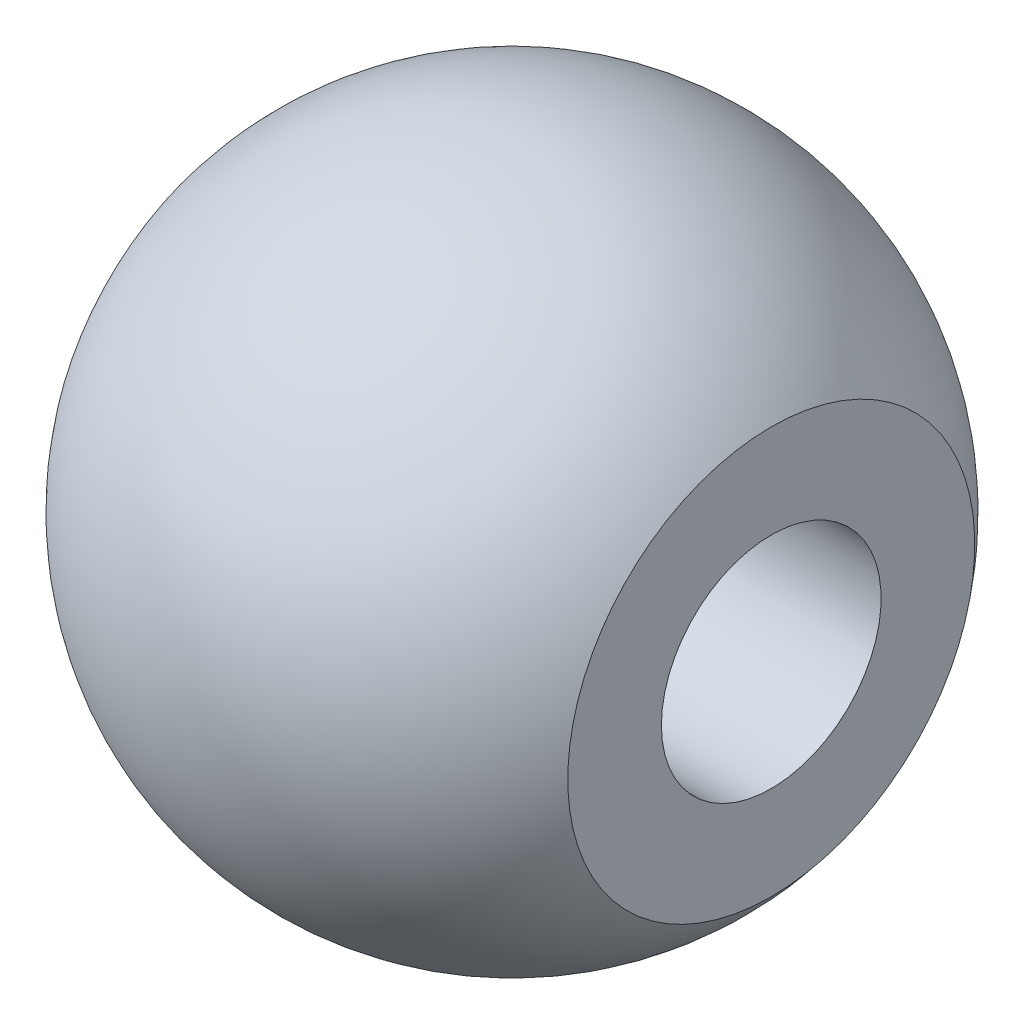
ISO-10303-21;
HEADER;
FILE_DESCRIPTION(('STEP AP214'),'2;1');
FILE_NAME('part.step','',(''),(''),'','','');
FILE_SCHEMA(('AUTOMOTIVE_DESIGN { 1 0 10303 214 1 1 1 1 }'));
ENDSEC;
DATA;
#1=APPLICATION_CONTEXT('core data for automotive mechanical design processes');
#2=APPLICATION_PROTOCOL_DEFINITION('international standard','automotive_design',2000,#1);
#3=PRODUCT_CONTEXT('',#1,'mechanical');
#4=PRODUCT('Part','Part','',(#3));
#5=PRODUCT_RELATED_PRODUCT_CATEGORY('part','',(#4));
#6=PRODUCT_DEFINITION_FORMATION('','',#4);
#7=PRODUCT_DEFINITION_CONTEXT('part definition',#1,'design');
#8=PRODUCT_DEFINITION('design','',#6,#7);
#9=PRODUCT_DEFINITION_SHAPE('','',#8);
#10=(LENGTH_UNIT() NAMED_UNIT(*) SI_UNIT(.MILLI.,.METRE.));
#11=(NAMED_UNIT(*) PLANE_ANGLE_UNIT() SI_UNIT($,.RADIAN.));
#12=(NAMED_UNIT(*) SI_UNIT($,.STERADIAN.) SOLID_ANGLE_UNIT());
#13=UNCERTAINTY_MEASURE_WITH_UNIT(LENGTH_MEASURE(1.E-05),#10,'distance_accuracy_value','');
#14=(GEOMETRIC_REPRESENTATION_CONTEXT(3) GLOBAL_UNCERTAINTY_ASSIGNED_CONTEXT((#13)) GLOBAL_UNIT_ASSIGNED_CONTEXT((#10,
#11,#12)) REPRESENTATION_CONTEXT('',''));
#15=CARTESIAN_POINT('',(0.,0.,0.));
#16=DIRECTION('',(0.,0.,1.));
#17=DIRECTION('',(1.,0.,0.));
#18=AXIS2_PLACEMENT_3D('',#15,#16,#17);
#19=CARTESIAN_POINT('',(-4.72,3.70426780889288,-6.));
#20=DIRECTION('',(1.,0.,0.));
#21=DIRECTION('',(0.,1.,0.));
#22=AXIS2_PLACEMENT_3D('',#19,#20,#21);
#23=PLANE('',#22);
#24=CARTESIAN_POINT('',(-4.72,0.,0.));
#25=DIRECTION('',(1.,0.,0.));
#26=DIRECTION('',(0.,1.,0.));
#27=AXIS2_PLACEMENT_3D('',#24,#25,#26);
#28=CIRCLE('',#27,3.70426780889287);
#29=CARTESIAN_POINT('',(-4.72,3.70426780889287,0.));
#30=VERTEX_POINT('',#29);
#31=EDGE_CURVE('E36',#30,#30,#28,.T.);
#32=ORIENTED_EDGE('',*,*,#31,.F.);
#33=EDGE_LOOP('',(#32));
#34=FACE_BOUND('',#33,.T.);
#35=CARTESIAN_POINT('',(-4.72,0.,0.));
#36=DIRECTION('',(-1.,0.,0.));
#37=DIRECTION('',(0.,0.,1.));
#38=AXIS2_PLACEMENT_3D('',#35,#36,#37);
#39=CIRCLE('',#38,3.44000000000002);
#40=CARTESIAN_POINT('',(-4.72,0.,3.44000000000002));
#41=VERTEX_POINT('',#40);
#42=EDGE_CURVE('E40',#41,#41,#39,.T.);
#43=ORIENTED_EDGE('',*,*,#42,.F.);
#44=EDGE_LOOP('',(#43));
#45=FACE_BOUND('',#44,.T.);
#46=ADVANCED_FACE('F29',(#34,#45),#23,.F.);
#47=CARTESIAN_POINT('',(4.72,3.70426780889287,-6.));
#48=DIRECTION('',(-1.,0.,0.));
#49=DIRECTION('',(0.,-1.,0.));
#50=AXIS2_PLACEMENT_3D('',#47,#48,#49);
#51=PLANE('',#50);
#52=CARTESIAN_POINT('',(4.72,0.,0.));
#53=DIRECTION('',(-1.,0.,0.));
#54=DIRECTION('',(0.,-1.,0.));
#55=AXIS2_PLACEMENT_3D('',#52,#53,#54);
#56=CIRCLE('',#55,3.70426780889287);
#57=CARTESIAN_POINT('',(4.72,-3.70426780889287,0.));
#58=VERTEX_POINT('',#57);
#59=EDGE_CURVE('E10',#58,#58,#56,.T.);
#60=ORIENTED_EDGE('',*,*,#59,.F.);
#61=EDGE_LOOP('',(#60));
#62=FACE_BOUND('',#61,.T.);
#63=CARTESIAN_POINT('',(4.72,0.,0.));
#64=DIRECTION('',(-1.,0.,0.));
#65=DIRECTION('',(0.,0.,1.));
#66=AXIS2_PLACEMENT_3D('',#63,#64,#65);
#67=CIRCLE('',#66,2.);
#68=CARTESIAN_POINT('',(4.72,0.,2.));
#69=VERTEX_POINT('',#68);
#70=EDGE_CURVE('E49',#69,#69,#67,.T.);
#71=ORIENTED_EDGE('',*,*,#70,.T.);
#72=EDGE_LOOP('',(#71));
#73=FACE_BOUND('',#72,.T.);
#74=ADVANCED_FACE('F53',(#62,#73),#51,.F.);
#75=CARTESIAN_POINT('',(0.,0.,0.));
#76=DIRECTION('',(-1.,0.,0.));
#77=DIRECTION('',(0.,1.,0.));
#78=AXIS2_PLACEMENT_3D('',#75,#76,#77);
#79=SPHERICAL_SURFACE('',#78,6.);
#80=ORIENTED_EDGE('',*,*,#59,.T.);
#81=EDGE_LOOP('',(#80));
#82=FACE_BOUND('',#81,.T.);
#83=ORIENTED_EDGE('',*,*,#31,.T.);
#84=EDGE_LOOP('',(#83));
#85=FACE_BOUND('',#84,.T.);
#86=ADVANCED_FACE('F31',(#82,#85),#79,.T.);
#87=CARTESIAN_POINT('',(-3.28,0.,0.));
#88=DIRECTION('',(-1.,0.,0.));
#89=DIRECTION('',(0.,0.,1.));
#90=AXIS2_PLACEMENT_3D('',#87,#88,#89);
#91=CONICAL_SURFACE('',#90,2.,0.785398163397453);
#92=ORIENTED_EDGE('',*,*,#42,.T.);
#93=EDGE_LOOP('',(#92));
#94=FACE_BOUND('',#93,.T.);
#95=CARTESIAN_POINT('',(-3.28,0.,0.));
#96=DIRECTION('',(-1.,0.,0.));
#97=DIRECTION('',(0.,0.,1.));
#98=AXIS2_PLACEMENT_3D('',#95,#96,#97);
#99=CIRCLE('',#98,2.);
#100=CARTESIAN_POINT('',(-3.28,0.,2.));
#101=VERTEX_POINT('',#100);
#102=EDGE_CURVE('E44',#101,#101,#99,.T.);
#103=ORIENTED_EDGE('',*,*,#102,.F.);
#104=EDGE_LOOP('',(#103));
#105=FACE_BOUND('',#104,.T.);
#106=ADVANCED_FACE('F57',(#94,#105),#91,.F.);
#107=CARTESIAN_POINT('',(-7.01052576318345,0.,0.));
#108=DIRECTION('',(-1.,0.,0.));
#109=DIRECTION('',(0.,0.,1.));
#110=AXIS2_PLACEMENT_3D('',#107,#108,#109);
#111=CYLINDRICAL_SURFACE('',#110,2.);
#112=ORIENTED_EDGE('',*,*,#102,.T.);
#113=EDGE_LOOP('',(#112));
#114=FACE_BOUND('',#113,.T.);
#115=ORIENTED_EDGE('',*,*,#70,.F.);
#116=EDGE_LOOP('',(#115));
#117=FACE_BOUND('',#116,.T.);
#118=ADVANCED_FACE('F55',(#114,#117),#111,.F.);
#119=CLOSED_SHELL('',(#46,#74,#86,#106,#118));
#120=MANIFOLD_SOLID_BREP('B2',#119);
#121=ADVANCED_BREP_SHAPE_REPRESENTATION('',(#18,#120),#14);
#122=SHAPE_DEFINITION_REPRESENTATION(#9,#121);
ENDSEC;
END-ISO-10303-21;
